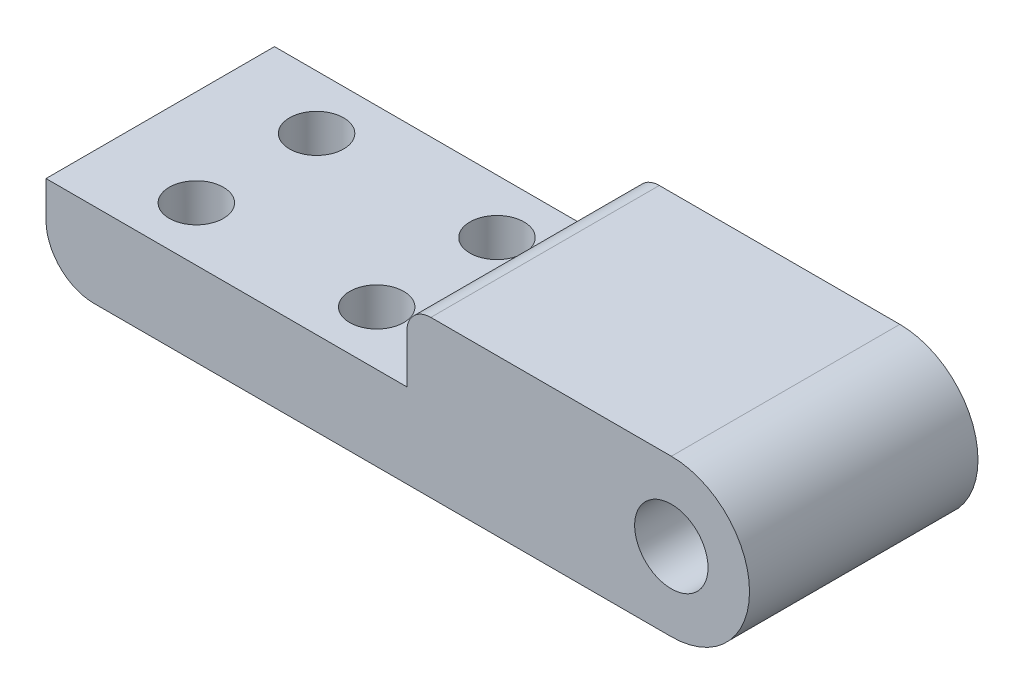
ISO-10303-21;
HEADER;
FILE_DESCRIPTION(('STEP AP214'),'2;1');
FILE_NAME('part.step','',(''),(''),'','','');
FILE_SCHEMA(('AUTOMOTIVE_DESIGN { 1 0 10303 214 1 1 1 1 }'));
ENDSEC;
DATA;
#1=APPLICATION_CONTEXT('core data for automotive mechanical design processes');
#2=APPLICATION_PROTOCOL_DEFINITION('international standard','automotive_design',2000,#1);
#3=PRODUCT_CONTEXT('',#1,'mechanical');
#4=PRODUCT('Part','Part','',(#3));
#5=PRODUCT_RELATED_PRODUCT_CATEGORY('part','',(#4));
#6=PRODUCT_DEFINITION_FORMATION('','',#4);
#7=PRODUCT_DEFINITION_CONTEXT('part definition',#1,'design');
#8=PRODUCT_DEFINITION('design','',#6,#7);
#9=PRODUCT_DEFINITION_SHAPE('','',#8);
#10=(LENGTH_UNIT() NAMED_UNIT(*) SI_UNIT(.MILLI.,.METRE.));
#11=(NAMED_UNIT(*) PLANE_ANGLE_UNIT() SI_UNIT($,.RADIAN.));
#12=(NAMED_UNIT(*) SI_UNIT($,.STERADIAN.) SOLID_ANGLE_UNIT());
#13=UNCERTAINTY_MEASURE_WITH_UNIT(LENGTH_MEASURE(1.E-05),#10,'distance_accuracy_value','');
#14=(GEOMETRIC_REPRESENTATION_CONTEXT(3) GLOBAL_UNCERTAINTY_ASSIGNED_CONTEXT((#13)) GLOBAL_UNIT_ASSIGNED_CONTEXT((#10,
#11,#12)) REPRESENTATION_CONTEXT('',''));
#15=CARTESIAN_POINT('',(0.,0.,0.));
#16=DIRECTION('',(0.,0.,1.));
#17=DIRECTION('',(1.,0.,0.));
#18=AXIS2_PLACEMENT_3D('',#15,#16,#17);
#19=CARTESIAN_POINT('',(23.7289738267999,2.45104895104895,19.));
#20=DIRECTION('',(0.,0.,1.));
#21=DIRECTION('',(1.,0.,0.));
#22=AXIS2_PLACEMENT_3D('',#19,#20,#21);
#23=PLANE('',#22);
#24=DIRECTION('',(-1.,0.,0.));
#25=VECTOR('',#24,1.);
#26=CARTESIAN_POINT('',(1.72897382679992,8.95104895104895,19.));
#27=LINE('',#26,#25);
#28=CARTESIAN_POINT('',(23.7289738267999,8.95104895104895,19.));
#29=VERTEX_POINT('',#28);
#30=CARTESIAN_POINT('',(3.72897382679992,8.95104895104895,19.));
#31=VERTEX_POINT('',#30);
#32=EDGE_CURVE('E97',#29,#31,#27,.T.);
#33=ORIENTED_EDGE('',*,*,#32,.T.);
#34=CARTESIAN_POINT('',(3.72897382679992,6.95104895104895,19.));
#35=DIRECTION('',(0.,0.,1.));
#36=DIRECTION('',(1.,0.,0.));
#37=AXIS2_PLACEMENT_3D('',#34,#35,#36);
#38=CIRCLE('',#37,2.);
#39=CARTESIAN_POINT('',(1.72897382679992,6.95104895104895,19.));
#40=VERTEX_POINT('',#39);
#41=EDGE_CURVE('E11',#31,#40,#38,.T.);
#42=ORIENTED_EDGE('',*,*,#41,.T.);
#43=DIRECTION('',(0.,-1.,0.));
#44=VECTOR('',#43,1.);
#45=CARTESIAN_POINT('',(1.72897382679992,8.95104895104895,19.));
#46=LINE('',#45,#44);
#47=CARTESIAN_POINT('',(1.72897382679992,2.95104895104895,19.));
#48=VERTEX_POINT('',#47);
#49=EDGE_CURVE('E105',#40,#48,#46,.T.);
#50=ORIENTED_EDGE('',*,*,#49,.T.);
#51=DIRECTION('',(-1.,0.,0.));
#52=VECTOR('',#51,1.);
#53=CARTESIAN_POINT('',(-28.2710261732001,2.95104895104895,19.));
#54=LINE('',#53,#52);
#55=CARTESIAN_POINT('',(-28.2710261732001,2.95104895104895,19.));
#56=VERTEX_POINT('',#55);
#57=EDGE_CURVE('E194',#48,#56,#54,.T.);
#58=ORIENTED_EDGE('',*,*,#57,.T.);
#59=DIRECTION('',(0.,-1.,0.));
#60=VECTOR('',#59,1.);
#61=CARTESIAN_POINT('',(-28.2710261732001,2.95104895104895,19.));
#62=LINE('',#61,#60);
#63=CARTESIAN_POINT('',(-28.2710261732001,-0.0489510489510465,19.));
#64=VERTEX_POINT('',#63);
#65=EDGE_CURVE('E183',#56,#64,#62,.T.);
#66=ORIENTED_EDGE('',*,*,#65,.T.);
#67=CARTESIAN_POINT('',(-24.2710261732001,-0.0489510489510465,19.));
#68=DIRECTION('',(0.,0.,1.));
#69=DIRECTION('',(1.,0.,0.));
#70=AXIS2_PLACEMENT_3D('',#67,#68,#69);
#71=CIRCLE('',#70,4.);
#72=CARTESIAN_POINT('',(-24.2710261732001,-4.04895104895105,19.));
#73=VERTEX_POINT('',#72);
#74=EDGE_CURVE('E148',#64,#73,#71,.T.);
#75=ORIENTED_EDGE('',*,*,#74,.T.);
#76=DIRECTION('',(1.,0.,0.));
#77=VECTOR('',#76,1.);
#78=CARTESIAN_POINT('',(-28.2710261732001,-4.04895104895105,19.));
#79=LINE('',#78,#77);
#80=CARTESIAN_POINT('',(23.7289738267999,-4.04895104895105,19.));
#81=VERTEX_POINT('',#80);
#82=EDGE_CURVE('E111',#73,#81,#79,.T.);
#83=ORIENTED_EDGE('',*,*,#82,.T.);
#84=CARTESIAN_POINT('',(23.7289738267999,2.45104895104895,19.));
#85=DIRECTION('',(0.,0.,1.));
#86=DIRECTION('',(1.,0.,0.));
#87=AXIS2_PLACEMENT_3D('',#84,#85,#86);
#88=CIRCLE('',#87,6.5);
#89=EDGE_CURVE('E106',#81,#29,#88,.T.);
#90=ORIENTED_EDGE('',*,*,#89,.T.);
#91=EDGE_LOOP('',(#33,#42,#50,#58,#66,#75,#83,#90));
#92=FACE_BOUND('',#91,.T.);
#93=CARTESIAN_POINT('',(23.7289738267999,2.45104895104895,19.));
#94=DIRECTION('',(0.,0.,1.));
#95=DIRECTION('',(1.,0.,0.));
#96=AXIS2_PLACEMENT_3D('',#93,#94,#95);
#97=CIRCLE('',#96,3.05);
#98=CARTESIAN_POINT('',(26.7789738267999,2.45104895104895,19.));
#99=VERTEX_POINT('',#98);
#100=EDGE_CURVE('E197',#99,#99,#97,.T.);
#101=ORIENTED_EDGE('',*,*,#100,.F.);
#102=EDGE_LOOP('',(#101));
#103=FACE_BOUND('',#102,.T.);
#104=ADVANCED_FACE('F36',(#92,#103),#23,.T.);
#105=CARTESIAN_POINT('',(23.7289738267999,2.45104895104895,0.));
#106=DIRECTION('',(0.,0.,1.));
#107=DIRECTION('',(1.,0.,0.));
#108=AXIS2_PLACEMENT_3D('',#105,#106,#107);
#109=PLANE('',#108);
#110=DIRECTION('',(0.,-1.,0.));
#111=VECTOR('',#110,1.);
#112=CARTESIAN_POINT('',(1.72897382679992,8.95104895104895,0.));
#113=LINE('',#112,#111);
#114=CARTESIAN_POINT('',(1.72897382679992,6.95104895104895,0.));
#115=VERTEX_POINT('',#114);
#116=CARTESIAN_POINT('',(1.72897382679992,2.95104895104895,0.));
#117=VERTEX_POINT('',#116);
#118=EDGE_CURVE('E158',#115,#117,#113,.T.);
#119=ORIENTED_EDGE('',*,*,#118,.F.);
#120=CARTESIAN_POINT('',(3.72897382679992,6.95104895104895,0.));
#121=DIRECTION('',(0.,0.,1.));
#122=DIRECTION('',(1.,0.,0.));
#123=AXIS2_PLACEMENT_3D('',#120,#121,#122);
#124=CIRCLE('',#123,2.);
#125=CARTESIAN_POINT('',(3.72897382679992,8.95104895104895,0.));
#126=VERTEX_POINT('',#125);
#127=EDGE_CURVE('E58',#115,#126,#124,.F.);
#128=ORIENTED_EDGE('',*,*,#127,.T.);
#129=DIRECTION('',(-1.,0.,0.));
#130=VECTOR('',#129,1.);
#131=CARTESIAN_POINT('',(1.72897382679992,8.95104895104895,0.));
#132=LINE('',#131,#130);
#133=CARTESIAN_POINT('',(23.7289738267999,8.95104895104895,0.));
#134=VERTEX_POINT('',#133);
#135=EDGE_CURVE('E165',#134,#126,#132,.T.);
#136=ORIENTED_EDGE('',*,*,#135,.F.);
#137=CARTESIAN_POINT('',(23.7289738267999,2.45104895104895,0.));
#138=DIRECTION('',(0.,0.,1.));
#139=DIRECTION('',(1.,0.,0.));
#140=AXIS2_PLACEMENT_3D('',#137,#138,#139);
#141=CIRCLE('',#140,6.5);
#142=CARTESIAN_POINT('',(23.7289738267999,-4.04895104895105,0.));
#143=VERTEX_POINT('',#142);
#144=EDGE_CURVE('E119',#143,#134,#141,.T.);
#145=ORIENTED_EDGE('',*,*,#144,.F.);
#146=DIRECTION('',(1.,0.,0.));
#147=VECTOR('',#146,1.);
#148=CARTESIAN_POINT('',(-28.2710261732001,-4.04895104895105,0.));
#149=LINE('',#148,#147);
#150=CARTESIAN_POINT('',(-24.2710261732001,-4.04895104895105,0.));
#151=VERTEX_POINT('',#150);
#152=EDGE_CURVE('E115',#151,#143,#149,.T.);
#153=ORIENTED_EDGE('',*,*,#152,.F.);
#154=CARTESIAN_POINT('',(-24.2710261732001,-0.0489510489510465,0.));
#155=DIRECTION('',(0.,0.,1.));
#156=DIRECTION('',(1.,0.,0.));
#157=AXIS2_PLACEMENT_3D('',#154,#155,#156);
#158=CIRCLE('',#157,4.);
#159=CARTESIAN_POINT('',(-28.2710261732001,-0.0489510489510465,0.));
#160=VERTEX_POINT('',#159);
#161=EDGE_CURVE('E124',#151,#160,#158,.F.);
#162=ORIENTED_EDGE('',*,*,#161,.T.);
#163=DIRECTION('',(0.,-1.,0.));
#164=VECTOR('',#163,1.);
#165=CARTESIAN_POINT('',(-28.2710261732001,2.95104895104895,0.));
#166=LINE('',#165,#164);
#167=CARTESIAN_POINT('',(-28.2710261732001,2.95104895104895,0.));
#168=VERTEX_POINT('',#167);
#169=EDGE_CURVE('E167',#168,#160,#166,.T.);
#170=ORIENTED_EDGE('',*,*,#169,.F.);
#171=DIRECTION('',(-1.,0.,0.));
#172=VECTOR('',#171,1.);
#173=CARTESIAN_POINT('',(-28.2710261732001,2.95104895104895,0.));
#174=LINE('',#173,#172);
#175=EDGE_CURVE('E164',#117,#168,#174,.T.);
#176=ORIENTED_EDGE('',*,*,#175,.F.);
#177=EDGE_LOOP('',(#119,#128,#136,#145,#153,#162,#170,#176));
#178=FACE_BOUND('',#177,.T.);
#179=CARTESIAN_POINT('',(23.7289738267999,2.45104895104895,0.));
#180=DIRECTION('',(0.,0.,1.));
#181=DIRECTION('',(1.,0.,0.));
#182=AXIS2_PLACEMENT_3D('',#179,#180,#181);
#183=CIRCLE('',#182,3.05);
#184=CARTESIAN_POINT('',(26.7789738267999,2.45104895104895,0.));
#185=VERTEX_POINT('',#184);
#186=EDGE_CURVE('E143',#185,#185,#183,.T.);
#187=ORIENTED_EDGE('',*,*,#186,.T.);
#188=EDGE_LOOP('',(#187));
#189=FACE_BOUND('',#188,.T.);
#190=ADVANCED_FACE('F161',(#178,#189),#109,.F.);
#191=CARTESIAN_POINT('',(23.7289738267999,2.45104895104895,19.));
#192=DIRECTION('',(0.,0.,-1.));
#193=DIRECTION('',(-1.,0.,0.));
#194=AXIS2_PLACEMENT_3D('',#191,#192,#193);
#195=CYLINDRICAL_SURFACE('',#194,6.5);
#196=ORIENTED_EDGE('',*,*,#144,.T.);
#197=DIRECTION('',(0.,0.,-1.));
#198=VECTOR('',#197,1.);
#199=CARTESIAN_POINT('',(23.7289738267999,8.95104895104895,19.));
#200=LINE('',#199,#198);
#201=EDGE_CURVE('E101',#29,#134,#200,.T.);
#202=ORIENTED_EDGE('',*,*,#201,.F.);
#203=ORIENTED_EDGE('',*,*,#89,.F.);
#204=DIRECTION('',(0.,0.,-1.));
#205=VECTOR('',#204,1.);
#206=CARTESIAN_POINT('',(23.7289738267999,-4.04895104895105,19.));
#207=LINE('',#206,#205);
#208=EDGE_CURVE('E175',#81,#143,#207,.T.);
#209=ORIENTED_EDGE('',*,*,#208,.T.);
#210=EDGE_LOOP('',(#196,#202,#203,#209));
#211=FACE_BOUND('',#210,.T.);
#212=ADVANCED_FACE('F117',(#211),#195,.T.);
#213=CARTESIAN_POINT('',(1.72897382679992,8.95104895104895,19.));
#214=DIRECTION('',(0.,-1.,0.));
#215=DIRECTION('',(0.,0.,-1.));
#216=AXIS2_PLACEMENT_3D('',#213,#214,#215);
#217=PLANE('',#216);
#218=ORIENTED_EDGE('',*,*,#135,.T.);
#219=DIRECTION('',(0.,0.,-1.));
#220=VECTOR('',#219,1.);
#221=CARTESIAN_POINT('',(3.72897382679992,8.95104895104895,19.));
#222=LINE('',#221,#220);
#223=EDGE_CURVE('E44',#126,#31,#222,.F.);
#224=ORIENTED_EDGE('',*,*,#223,.T.);
#225=ORIENTED_EDGE('',*,*,#32,.F.);
#226=ORIENTED_EDGE('',*,*,#201,.T.);
#227=EDGE_LOOP('',(#218,#224,#225,#226));
#228=FACE_BOUND('',#227,.T.);
#229=ADVANCED_FACE('F99',(#228),#217,.F.);
#230=CARTESIAN_POINT('',(1.72897382679992,8.95104895104895,19.));
#231=DIRECTION('',(1.,0.,0.));
#232=DIRECTION('',(0.,0.,-1.));
#233=AXIS2_PLACEMENT_3D('',#230,#231,#232);
#234=PLANE('',#233);
#235=ORIENTED_EDGE('',*,*,#49,.F.);
#236=DIRECTION('',(0.,0.,-1.));
#237=VECTOR('',#236,1.);
#238=CARTESIAN_POINT('',(1.72897382679992,6.95104895104895,19.));
#239=LINE('',#238,#237);
#240=EDGE_CURVE('E150',#40,#115,#239,.T.);
#241=ORIENTED_EDGE('',*,*,#240,.T.);
#242=ORIENTED_EDGE('',*,*,#118,.T.);
#243=DIRECTION('',(0.,0.,-1.));
#244=VECTOR('',#243,1.);
#245=CARTESIAN_POINT('',(1.72897382679992,2.95104895104895,19.));
#246=LINE('',#245,#244);
#247=EDGE_CURVE('E121',#48,#117,#246,.T.);
#248=ORIENTED_EDGE('',*,*,#247,.F.);
#249=EDGE_LOOP('',(#235,#241,#242,#248));
#250=FACE_BOUND('',#249,.T.);
#251=ADVANCED_FACE('F156',(#250),#234,.F.);
#252=CARTESIAN_POINT('',(-28.2710261732001,2.95104895104895,19.));
#253=DIRECTION('',(0.,-1.,0.));
#254=DIRECTION('',(1.,0.,0.));
#255=AXIS2_PLACEMENT_3D('',#252,#253,#254);
#256=PLANE('',#255);
#257=CARTESIAN_POINT('',(-20.2710261732001,2.95104895104895,14.5));
#258=DIRECTION('',(0.,1.,0.));
#259=DIRECTION('',(0.,0.,-1.));
#260=AXIS2_PLACEMENT_3D('',#257,#258,#259);
#261=CIRCLE('',#260,2.25);
#262=CARTESIAN_POINT('',(-20.2710261732001,2.95104895104895,12.25));
#263=VERTEX_POINT('',#262);
#264=EDGE_CURVE('E267',#263,#263,#261,.T.);
#265=ORIENTED_EDGE('',*,*,#264,.F.);
#266=EDGE_LOOP('',(#265));
#267=FACE_BOUND('',#266,.T.);
#268=CARTESIAN_POINT('',(-5.27102617320008,2.95104895104895,14.5));
#269=DIRECTION('',(0.,1.,0.));
#270=DIRECTION('',(0.,0.,-1.));
#271=AXIS2_PLACEMENT_3D('',#268,#269,#270);
#272=CIRCLE('',#271,2.25);
#273=CARTESIAN_POINT('',(-5.27102617320008,2.95104895104895,12.25));
#274=VERTEX_POINT('',#273);
#275=EDGE_CURVE('E265',#274,#274,#272,.T.);
#276=ORIENTED_EDGE('',*,*,#275,.F.);
#277=EDGE_LOOP('',(#276));
#278=FACE_BOUND('',#277,.T.);
#279=CARTESIAN_POINT('',(-5.27102617320008,2.95104895104895,4.5));
#280=DIRECTION('',(0.,1.,0.));
#281=DIRECTION('',(0.,0.,1.));
#282=AXIS2_PLACEMENT_3D('',#279,#280,#281);
#283=CIRCLE('',#282,2.25);
#284=CARTESIAN_POINT('',(-5.27102617320008,2.95104895104895,6.75));
#285=VERTEX_POINT('',#284);
#286=EDGE_CURVE('E266',#285,#285,#283,.T.);
#287=ORIENTED_EDGE('',*,*,#286,.F.);
#288=EDGE_LOOP('',(#287));
#289=FACE_BOUND('',#288,.T.);
#290=CARTESIAN_POINT('',(-20.2710261732001,2.95104895104895,4.5));
#291=DIRECTION('',(0.,1.,0.));
#292=DIRECTION('',(0.,0.,1.));
#293=AXIS2_PLACEMENT_3D('',#290,#291,#292);
#294=CIRCLE('',#293,2.25);
#295=CARTESIAN_POINT('',(-20.2710261732001,2.95104895104895,6.75));
#296=VERTEX_POINT('',#295);
#297=EDGE_CURVE('E135',#296,#296,#294,.T.);
#298=ORIENTED_EDGE('',*,*,#297,.F.);
#299=EDGE_LOOP('',(#298));
#300=FACE_BOUND('',#299,.T.);
#301=ORIENTED_EDGE('',*,*,#175,.T.);
#302=DIRECTION('',(0.,0.,-1.));
#303=VECTOR('',#302,1.);
#304=CARTESIAN_POINT('',(-28.2710261732001,2.95104895104895,19.));
#305=LINE('',#304,#303);
#306=EDGE_CURVE('E127',#56,#168,#305,.T.);
#307=ORIENTED_EDGE('',*,*,#306,.F.);
#308=ORIENTED_EDGE('',*,*,#57,.F.);
#309=ORIENTED_EDGE('',*,*,#247,.T.);
#310=EDGE_LOOP('',(#301,#307,#308,#309));
#311=FACE_BOUND('',#310,.T.);
#312=ADVANCED_FACE('F207',(#267,#278,#289,#300,#311),#256,.F.);
#313=CARTESIAN_POINT('',(-28.2710261732001,2.95104895104895,19.));
#314=DIRECTION('',(1.,0.,0.));
#315=DIRECTION('',(0.,0.,-1.));
#316=AXIS2_PLACEMENT_3D('',#313,#314,#315);
#317=PLANE('',#316);
#318=ORIENTED_EDGE('',*,*,#169,.T.);
#319=DIRECTION('',(0.,0.,-1.));
#320=VECTOR('',#319,1.);
#321=CARTESIAN_POINT('',(-28.2710261732001,-0.0489510489510465,19.));
#322=LINE('',#321,#320);
#323=EDGE_CURVE('E146',#160,#64,#322,.F.);
#324=ORIENTED_EDGE('',*,*,#323,.T.);
#325=ORIENTED_EDGE('',*,*,#65,.F.);
#326=ORIENTED_EDGE('',*,*,#306,.T.);
#327=EDGE_LOOP('',(#318,#324,#325,#326));
#328=FACE_BOUND('',#327,.T.);
#329=ADVANCED_FACE('F180',(#328),#317,.F.);
#330=CARTESIAN_POINT('',(-28.2710261732001,-4.04895104895105,19.));
#331=DIRECTION('',(0.,1.,0.));
#332=DIRECTION('',(0.,0.,1.));
#333=AXIS2_PLACEMENT_3D('',#330,#331,#332);
#334=PLANE('',#333);
#335=CARTESIAN_POINT('',(-20.2710261732001,-4.04895104895105,14.5));
#336=DIRECTION('',(0.,1.,0.));
#337=DIRECTION('',(0.,0.,1.));
#338=AXIS2_PLACEMENT_3D('',#335,#336,#337);
#339=CIRCLE('',#338,2.25);
#340=CARTESIAN_POINT('',(-20.2710261732001,-4.04895104895105,16.75));
#341=VERTEX_POINT('',#340);
#342=EDGE_CURVE('E141',#341,#341,#339,.T.);
#343=ORIENTED_EDGE('',*,*,#342,.T.);
#344=EDGE_LOOP('',(#343));
#345=FACE_BOUND('',#344,.T.);
#346=CARTESIAN_POINT('',(-5.27102617320008,-4.04895104895105,14.5));
#347=DIRECTION('',(0.,1.,0.));
#348=DIRECTION('',(0.,0.,1.));
#349=AXIS2_PLACEMENT_3D('',#346,#347,#348);
#350=CIRCLE('',#349,2.25);
#351=CARTESIAN_POINT('',(-5.27102617320008,-4.04895104895105,16.75));
#352=VERTEX_POINT('',#351);
#353=EDGE_CURVE('E138',#352,#352,#350,.T.);
#354=ORIENTED_EDGE('',*,*,#353,.T.);
#355=EDGE_LOOP('',(#354));
#356=FACE_BOUND('',#355,.T.);
#357=CARTESIAN_POINT('',(-5.27102617320008,-4.04895104895105,4.5));
#358=DIRECTION('',(0.,1.,0.));
#359=DIRECTION('',(0.,0.,1.));
#360=AXIS2_PLACEMENT_3D('',#357,#358,#359);
#361=CIRCLE('',#360,2.25);
#362=CARTESIAN_POINT('',(-5.27102617320008,-4.04895104895105,6.75));
#363=VERTEX_POINT('',#362);
#364=EDGE_CURVE('E134',#363,#363,#361,.T.);
#365=ORIENTED_EDGE('',*,*,#364,.T.);
#366=EDGE_LOOP('',(#365));
#367=FACE_BOUND('',#366,.T.);
#368=CARTESIAN_POINT('',(-20.2710261732001,-4.04895104895105,4.5));
#369=DIRECTION('',(0.,1.,0.));
#370=DIRECTION('',(0.,0.,1.));
#371=AXIS2_PLACEMENT_3D('',#368,#369,#370);
#372=CIRCLE('',#371,2.25);
#373=CARTESIAN_POINT('',(-20.2710261732001,-4.04895104895105,6.75));
#374=VERTEX_POINT('',#373);
#375=EDGE_CURVE('E131',#374,#374,#372,.T.);
#376=ORIENTED_EDGE('',*,*,#375,.T.);
#377=EDGE_LOOP('',(#376));
#378=FACE_BOUND('',#377,.T.);
#379=ORIENTED_EDGE('',*,*,#82,.F.);
#380=DIRECTION('',(0.,0.,-1.));
#381=VECTOR('',#380,1.);
#382=CARTESIAN_POINT('',(-24.2710261732001,-4.04895104895105,19.));
#383=LINE('',#382,#381);
#384=EDGE_CURVE('E120',#73,#151,#383,.T.);
#385=ORIENTED_EDGE('',*,*,#384,.T.);
#386=ORIENTED_EDGE('',*,*,#152,.T.);
#387=ORIENTED_EDGE('',*,*,#208,.F.);
#388=EDGE_LOOP('',(#379,#385,#386,#387));
#389=FACE_BOUND('',#388,.T.);
#390=ADVANCED_FACE('F192',(#345,#356,#367,#378,#389),#334,.F.);
#391=CARTESIAN_POINT('',(23.7289738267999,2.45104895104895,19.));
#392=DIRECTION('',(0.,0.,-1.));
#393=DIRECTION('',(-1.,0.,0.));
#394=AXIS2_PLACEMENT_3D('',#391,#392,#393);
#395=CYLINDRICAL_SURFACE('',#394,3.05);
#396=ORIENTED_EDGE('',*,*,#100,.T.);
#397=EDGE_LOOP('',(#396));
#398=FACE_BOUND('',#397,.T.);
#399=ORIENTED_EDGE('',*,*,#186,.F.);
#400=EDGE_LOOP('',(#399));
#401=FACE_BOUND('',#400,.T.);
#402=ADVANCED_FACE('F226',(#398,#401),#395,.F.);
#403=CARTESIAN_POINT('',(-20.2710261732001,-17.048951048951,4.5));
#404=DIRECTION('',(0.,1.,0.));
#405=DIRECTION('',(0.,0.,1.));
#406=AXIS2_PLACEMENT_3D('',#403,#404,#405);
#407=CYLINDRICAL_SURFACE('',#406,2.25);
#408=ORIENTED_EDGE('',*,*,#297,.T.);
#409=EDGE_LOOP('',(#408));
#410=FACE_BOUND('',#409,.T.);
#411=ORIENTED_EDGE('',*,*,#375,.F.);
#412=EDGE_LOOP('',(#411));
#413=FACE_BOUND('',#412,.T.);
#414=ADVANCED_FACE('F234',(#410,#413),#407,.F.);
#415=CARTESIAN_POINT('',(-5.27102617320008,-17.048951048951,4.5));
#416=DIRECTION('',(0.,1.,0.));
#417=DIRECTION('',(0.,0.,1.));
#418=AXIS2_PLACEMENT_3D('',#415,#416,#417);
#419=CYLINDRICAL_SURFACE('',#418,2.25);
#420=ORIENTED_EDGE('',*,*,#286,.T.);
#421=EDGE_LOOP('',(#420));
#422=FACE_BOUND('',#421,.T.);
#423=ORIENTED_EDGE('',*,*,#364,.F.);
#424=EDGE_LOOP('',(#423));
#425=FACE_BOUND('',#424,.T.);
#426=ADVANCED_FACE('F244',(#422,#425),#419,.F.);
#427=CARTESIAN_POINT('',(-5.27102617320008,-17.048951048951,14.5));
#428=DIRECTION('',(0.,1.,0.));
#429=DIRECTION('',(0.,0.,1.));
#430=AXIS2_PLACEMENT_3D('',#427,#428,#429);
#431=CYLINDRICAL_SURFACE('',#430,2.25);
#432=ORIENTED_EDGE('',*,*,#275,.T.);
#433=EDGE_LOOP('',(#432));
#434=FACE_BOUND('',#433,.T.);
#435=ORIENTED_EDGE('',*,*,#353,.F.);
#436=EDGE_LOOP('',(#435));
#437=FACE_BOUND('',#436,.T.);
#438=ADVANCED_FACE('F249',(#434,#437),#431,.F.);
#439=CARTESIAN_POINT('',(-20.2710261732001,-17.048951048951,14.5));
#440=DIRECTION('',(0.,1.,0.));
#441=DIRECTION('',(0.,0.,1.));
#442=AXIS2_PLACEMENT_3D('',#439,#440,#441);
#443=CYLINDRICAL_SURFACE('',#442,2.25);
#444=ORIENTED_EDGE('',*,*,#264,.T.);
#445=EDGE_LOOP('',(#444));
#446=FACE_BOUND('',#445,.T.);
#447=ORIENTED_EDGE('',*,*,#342,.F.);
#448=EDGE_LOOP('',(#447));
#449=FACE_BOUND('',#448,.T.);
#450=ADVANCED_FACE('F254',(#446,#449),#443,.F.);
#451=CARTESIAN_POINT('',(-24.2710261732001,-0.0489510489510465,19.));
#452=DIRECTION('',(0.,0.,-1.));
#453=DIRECTION('',(-1.,0.,0.));
#454=AXIS2_PLACEMENT_3D('',#451,#452,#453);
#455=CYLINDRICAL_SURFACE('',#454,4.);
#456=ORIENTED_EDGE('',*,*,#74,.F.);
#457=ORIENTED_EDGE('',*,*,#323,.F.);
#458=ORIENTED_EDGE('',*,*,#161,.F.);
#459=ORIENTED_EDGE('',*,*,#384,.F.);
#460=EDGE_LOOP('',(#456,#457,#458,#459));
#461=FACE_BOUND('',#460,.T.);
#462=ADVANCED_FACE('F190',(#461),#455,.T.);
#463=CARTESIAN_POINT('',(3.72897382679992,6.95104895104895,19.));
#464=DIRECTION('',(0.,0.,-1.));
#465=DIRECTION('',(-1.,0.,0.));
#466=AXIS2_PLACEMENT_3D('',#463,#464,#465);
#467=CYLINDRICAL_SURFACE('',#466,2.);
#468=ORIENTED_EDGE('',*,*,#41,.F.);
#469=ORIENTED_EDGE('',*,*,#223,.F.);
#470=ORIENTED_EDGE('',*,*,#127,.F.);
#471=ORIENTED_EDGE('',*,*,#240,.F.);
#472=EDGE_LOOP('',(#468,#469,#470,#471));
#473=FACE_BOUND('',#472,.T.);
#474=ADVANCED_FACE('F38',(#473),#467,.T.);
#475=CLOSED_SHELL('',(#104,#190,#212,#229,#251,#312,#329,#390,#402,#414,#426,#438,#450,#462,#474));
#476=MANIFOLD_SOLID_BREP('B2',#475);
#477=ADVANCED_BREP_SHAPE_REPRESENTATION('',(#18,#476),#14);
#478=SHAPE_DEFINITION_REPRESENTATION(#9,#477);
ENDSEC;
END-ISO-10303-21;
